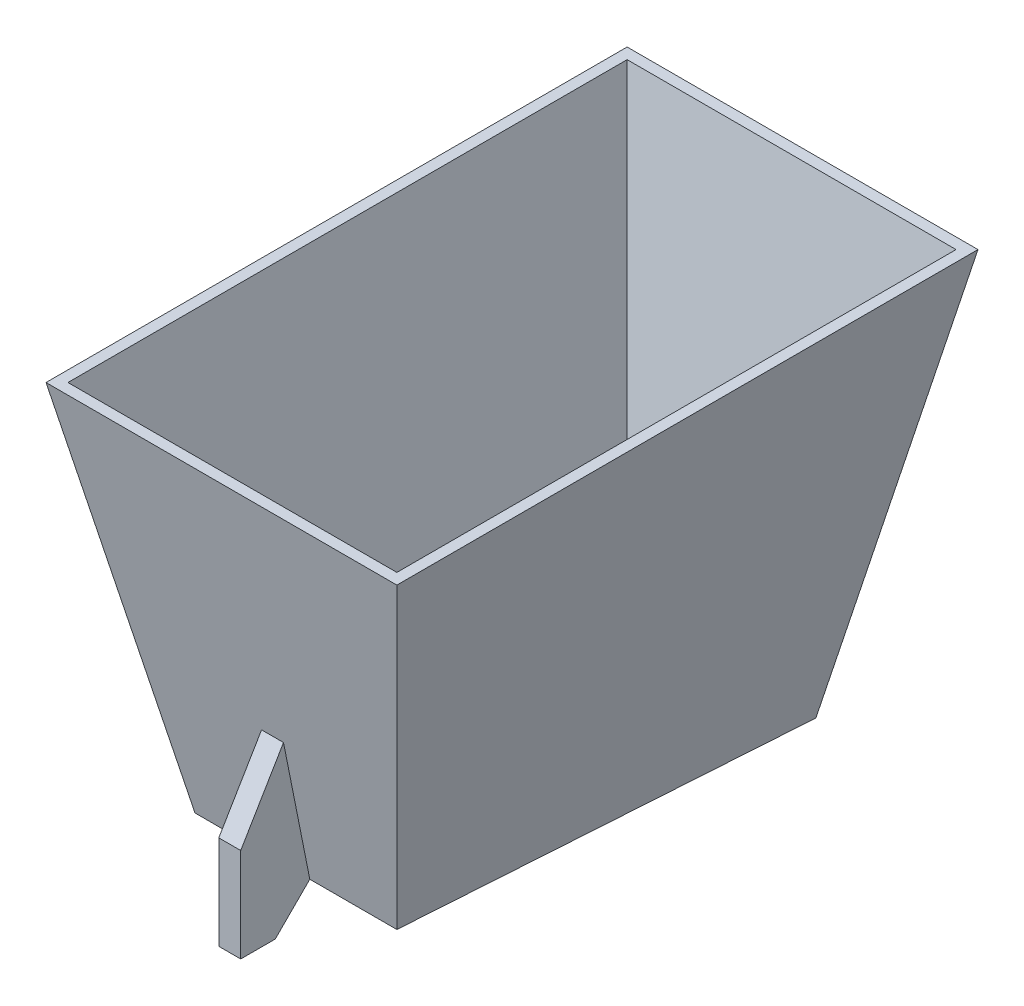
ISO-10303-21;
HEADER;
FILE_DESCRIPTION(('STEP AP214'),'2;1');
FILE_NAME('part.step','',(''),(''),'','','');
FILE_SCHEMA(('AUTOMOTIVE_DESIGN { 1 0 10303 214 1 1 1 1 }'));
ENDSEC;
DATA;
#1=APPLICATION_CONTEXT('core data for automotive mechanical design processes');
#2=APPLICATION_PROTOCOL_DEFINITION('international standard','automotive_design',2000,#1);
#3=PRODUCT_CONTEXT('',#1,'mechanical');
#4=PRODUCT('Part','Part','',(#3));
#5=PRODUCT_RELATED_PRODUCT_CATEGORY('part','',(#4));
#6=PRODUCT_DEFINITION_FORMATION('','',#4);
#7=PRODUCT_DEFINITION_CONTEXT('part definition',#1,'design');
#8=PRODUCT_DEFINITION('design','',#6,#7);
#9=PRODUCT_DEFINITION_SHAPE('','',#8);
#10=(LENGTH_UNIT() NAMED_UNIT(*) SI_UNIT(.MILLI.,.METRE.));
#11=(NAMED_UNIT(*) PLANE_ANGLE_UNIT() SI_UNIT($,.RADIAN.));
#12=(NAMED_UNIT(*) SI_UNIT($,.STERADIAN.) SOLID_ANGLE_UNIT());
#13=UNCERTAINTY_MEASURE_WITH_UNIT(LENGTH_MEASURE(1.E-05),#10,'distance_accuracy_value','');
#14=(GEOMETRIC_REPRESENTATION_CONTEXT(3) GLOBAL_UNCERTAINTY_ASSIGNED_CONTEXT((#13)) GLOBAL_UNIT_ASSIGNED_CONTEXT((#10,
#11,#12)) REPRESENTATION_CONTEXT('',''));
#15=CARTESIAN_POINT('',(0.,0.,0.));
#16=DIRECTION('',(0.,0.,1.));
#17=DIRECTION('',(1.,0.,0.));
#18=AXIS2_PLACEMENT_3D('',#15,#16,#17);
#19=CARTESIAN_POINT('',(-278.502356020751,235.900000000131,196.151832460941));
#20=DIRECTION('',(1.15994049915103E-12,-0.195090322015335,0.980785280403388));
#21=DIRECTION('',(2.307265107047E-13,0.980785280403388,0.195090322015335));
#22=AXIS2_PLACEMENT_3D('',#19,#20,#21);
#23=PLANE('',#22);
#24=DIRECTION('',(1.,0.,-1.18266507698195E-12));
#25=VECTOR('',#24,1.);
#26=CARTESIAN_POINT('',(-278.5023560208,25.9852869008242,154.397199930713));
#27=LINE('',#26,#25);
#28=CARTESIAN_POINT('',(-236.747723490402,25.9852869008242,154.397199930664));
#29=VERTEX_POINT('',#28);
#30=CARTESIAN_POINT('',(-129.756988551199,25.9852869008242,154.397199930537));
#31=VERTEX_POINT('',#30);
#32=EDGE_CURVE('E57',#29,#31,#27,.T.);
#33=ORIENTED_EDGE('',*,*,#32,.F.);
#34=DIRECTION('',(-0.191480453955097,0.962637248139934,0.191480453954771));
#35=VECTOR('',#34,1.);
#36=CARTESIAN_POINT('',(-266.628472119395,176.205954537845,184.277948559605));
#37=LINE('',#36,#35);
#38=CARTESIAN_POINT('',(-278.502356020751,235.900000000131,196.151832460941));
#39=VERTEX_POINT('',#38);
#40=EDGE_CURVE('E245',#29,#39,#37,.T.);
#41=ORIENTED_EDGE('',*,*,#40,.T.);
#42=DIRECTION('',(1.,0.,-1.18266507698195E-12));
#43=VECTOR('',#42,1.);
#44=CARTESIAN_POINT('',(-278.502356020751,235.900000000131,196.151832460941));
#45=LINE('',#44,#43);
#46=CARTESIAN_POINT('',(-88.002356020751,235.900000000131,196.151832460716));
#47=VERTEX_POINT('',#46);
#48=EDGE_CURVE('E232',#39,#47,#45,.T.);
#49=ORIENTED_EDGE('',*,*,#48,.T.);
#50=DIRECTION('',(0.19148045395555,0.962637248139934,0.191480453954318));
#51=VECTOR('',#50,1.);
#52=CARTESIAN_POINT('',(-94.9869936098007,200.785855610551,189.167194871711));
#53=LINE('',#52,#51);
#54=EDGE_CURVE('E147',#31,#47,#53,.T.);
#55=ORIENTED_EDGE('',*,*,#54,.F.);
#56=EDGE_LOOP('',(#33,#41,#49,#55));
#57=FACE_BOUND('',#56,.T.);
#58=ADVANCED_FACE('F41',(#57),#23,.F.);
#59=CARTESIAN_POINT('',(-278.502356021134,235.899999999869,-127.698167539059));
#60=DIRECTION('',(-0.980785280403231,-0.195090322016129,1.31765583014147E-12));
#61=DIRECTION('',(0.195090322016129,-0.98078528040323,5.625845905911E-13));
#62=AXIS2_PLACEMENT_3D('',#59,#60,#61);
#63=PLANE('',#62);
#64=DIRECTION('',(-0.015327226937019,0.0770551732919837,0.996909011085447));
#65=VECTOR('',#64,1.);
#66=CARTESIAN_POINT('',(-232.695075686753,5.61125054808387,-109.193933078214));
#67=LINE('',#66,#65);
#68=CARTESIAN_POINT('',(-233.108496945998,7.68965957175238,-82.3043084638459));
#69=VERTEX_POINT('',#68);
#70=EDGE_CURVE('E64',#69,#29,#67,.T.);
#71=ORIENTED_EDGE('',*,*,#70,.F.);
#72=DIRECTION('',(-0.19148045395555,0.962637248139624,-0.191480453955875));
#73=VECTOR('',#72,1.);
#74=CARTESIAN_POINT('',(-271.517718432084,200.7858556103,-120.713529949997));
#75=LINE('',#74,#73);
#76=CARTESIAN_POINT('',(-278.502356021134,235.899999999869,-127.698167539059));
#77=VERTEX_POINT('',#76);
#78=EDGE_CURVE('E146',#69,#77,#75,.T.);
#79=ORIENTED_EDGE('',*,*,#78,.T.);
#80=DIRECTION('',(1.18257937194685E-12,8.08852984590658E-13,1.));
#81=VECTOR('',#80,1.);
#82=CARTESIAN_POINT('',(-278.502356021134,235.899999999869,-127.698167539059));
#83=LINE('',#82,#81);
#84=EDGE_CURVE('E241',#77,#39,#83,.T.);
#85=ORIENTED_EDGE('',*,*,#84,.T.);
#86=ORIENTED_EDGE('',*,*,#40,.F.);
#87=EDGE_LOOP('',(#71,#79,#85,#86));
#88=FACE_BOUND('',#87,.T.);
#89=ADVANCED_FACE('F310',(#88),#63,.F.);
#90=CARTESIAN_POINT('',(-88.002356021134,235.899999999869,-127.698167539284));
#91=DIRECTION('',(-1.15994049915066E-12,-0.195090322016922,-0.980785280403073));
#92=DIRECTION('',(2.30726510706576E-13,-0.980785280403073,0.195090322016922));
#93=AXIS2_PLACEMENT_3D('',#90,#91,#92);
#94=PLANE('',#93);
#95=DIRECTION('',(-1.,0.,1.18266507698195E-12));
#96=VECTOR('',#95,1.);
#97=CARTESIAN_POINT('',(-88.0023560210803,7.68965957175241,-82.3043084640175));
#98=LINE('',#97,#96);
#99=CARTESIAN_POINT('',(-133.396215096162,7.68965957175236,-82.3043084639638));
#100=VERTEX_POINT('',#99);
#101=EDGE_CURVE('E150',#100,#69,#98,.T.);
#102=ORIENTED_EDGE('',*,*,#101,.F.);
#103=DIRECTION('',(0.191480453955097,0.962637248139624,-0.191480453956328));
#104=VECTOR('',#103,1.);
#105=CARTESIAN_POINT('',(-99.8762399224904,176.205954537602,-115.824283637851));
#106=LINE('',#105,#104);
#107=CARTESIAN_POINT('',(-88.002356021134,235.899999999869,-127.698167539284));
#108=VERTEX_POINT('',#107);
#109=EDGE_CURVE('E137',#100,#108,#106,.T.);
#110=ORIENTED_EDGE('',*,*,#109,.T.);
#111=DIRECTION('',(-1.,0.,1.18266507698195E-12));
#112=VECTOR('',#111,1.);
#113=CARTESIAN_POINT('',(-88.002356021134,235.899999999869,-127.698167539284));
#114=LINE('',#113,#112);
#115=EDGE_CURVE('E238',#108,#77,#114,.T.);
#116=ORIENTED_EDGE('',*,*,#115,.T.);
#117=ORIENTED_EDGE('',*,*,#78,.F.);
#118=EDGE_LOOP('',(#102,#110,#116,#117));
#119=FACE_BOUND('',#118,.T.);
#120=ADVANCED_FACE('F151',(#119),#94,.F.);
#121=CARTESIAN_POINT('',(-88.002356020751,235.900000000131,196.151832460716));
#122=DIRECTION('',(0.980785280403231,-0.195090322016129,-1.00197299344959E-12));
#123=DIRECTION('',(0.195090322016129,0.98078528040323,-1.02403761200238E-12));
#124=AXIS2_PLACEMENT_3D('',#121,#122,#123);
#125=PLANE('',#124);
#126=DIRECTION('',(-0.0153272269393768,-0.0770551732919837,-0.996909011085411));
#127=VECTOR('',#126,1.);
#128=CARTESIAN_POINT('',(-128.861256722204,30.4884348987856,212.657127533424));
#129=LINE('',#128,#127);
#130=EDGE_CURVE('E11',#31,#100,#129,.T.);
#131=ORIENTED_EDGE('',*,*,#130,.F.);
#132=ORIENTED_EDGE('',*,*,#54,.T.);
#133=DIRECTION('',(-1.18249366691176E-12,-8.08852984590658E-13,-1.));
#134=VECTOR('',#133,1.);
#135=CARTESIAN_POINT('',(-88.002356020751,235.900000000131,196.151832460716));
#136=LINE('',#135,#134);
#137=EDGE_CURVE('E141',#47,#108,#136,.T.);
#138=ORIENTED_EDGE('',*,*,#137,.T.);
#139=ORIENTED_EDGE('',*,*,#109,.F.);
#140=EDGE_LOOP('',(#131,#132,#138,#139));
#141=FACE_BOUND('',#140,.T.);
#142=ADVANCED_FACE('F139',(#141),#125,.F.);
#143=CARTESIAN_POINT('',(-81.6523560211415,235.899999999864,-134.048167539291));
#144=DIRECTION('',(0.980614658546613,-0.195946144242518,-1.00108534273686E-12));
#145=DIRECTION('',(0.195946144242518,0.980614658546613,-1.02491175506367E-12));
#146=AXIS2_PLACEMENT_3D('',#143,#144,#145);
#147=PLANE('',#146);
#148=DIRECTION('',(-0.0153971264380116,-0.0770550905300004,-0.996907940343975));
#149=VECTOR('',#148,1.);
#150=CARTESIAN_POINT('',(-129.03074139707,-1.20565664639494,-114.9895483236));
#151=LINE('',#150,#149);
#152=CARTESIAN_POINT('',(-128.599998694522,0.949999999902085,-87.1005248656101));
#153=VERTEX_POINT('',#152);
#154=CARTESIAN_POINT('',(-124.79343307206,20.0000000001014,159.360755409669));
#155=VERTEX_POINT('',#154);
#156=EDGE_CURVE('E228',#153,#155,#151,.F.);
#157=ORIENTED_EDGE('',*,*,#156,.F.);
#158=DIRECTION('',(0.192289447047811,0.962314676759957,-0.192289447049044));
#159=VECTOR('',#158,1.);
#160=CARTESIAN_POINT('',(-81.6523560211415,235.899999999864,-134.048167539291));
#161=LINE('',#160,#159);
#162=CARTESIAN_POINT('',(-81.6523560211415,235.899999999864,-134.048167539291));
#163=VERTEX_POINT('',#162);
#164=EDGE_CURVE('E268',#153,#163,#161,.T.);
#165=ORIENTED_EDGE('',*,*,#164,.T.);
#166=DIRECTION('',(1.18250013521629E-12,8.08852984590658E-13,1.));
#167=VECTOR('',#166,1.);
#168=CARTESIAN_POINT('',(-81.6523560211415,235.899999999864,-134.048167539291));
#169=LINE('',#168,#167);
#170=CARTESIAN_POINT('',(-81.6523560207435,235.900000000136,202.501832460709));
#171=VERTEX_POINT('',#170);
#172=EDGE_CURVE('E248',#163,#171,#169,.T.);
#173=ORIENTED_EDGE('',*,*,#172,.T.);
#174=DIRECTION('',(0.192289447048266,0.962314676760268,0.192289447047033));
#175=VECTOR('',#174,1.);
#176=CARTESIAN_POINT('',(-81.6523560207435,235.900000000136,202.501832460709));
#177=LINE('',#176,#175);
#178=EDGE_CURVE('E50',#155,#171,#177,.T.);
#179=ORIENTED_EDGE('',*,*,#178,.F.);
#180=EDGE_LOOP('',(#157,#165,#173,#179));
#181=FACE_BOUND('',#180,.T.);
#182=ADVANCED_FACE('F299',(#181),#147,.T.);
#183=CARTESIAN_POINT('',(-81.6523560207435,235.900000000136,202.501832460709));
#184=DIRECTION('',(1.15973871063984E-12,-0.195946144241725,0.980614658546772));
#185=DIRECTION('',(2.31738661763956E-13,0.980614658546772,0.195946144241725));
#186=AXIS2_PLACEMENT_3D('',#183,#184,#185);
#187=PLANE('',#186);
#188=DIRECTION('',(1.,0.,-1.18266507698195E-12));
#189=VECTOR('',#188,1.);
#190=CARTESIAN_POINT('',(-187.922312041719,96.2000000001137,174.587017898364));
#191=LINE('',#190,#189);
#192=CARTESIAN_POINT('',(-187.922312041719,96.2000000001137,174.587017898364));
#193=VERTEX_POINT('',#192);
#194=CARTESIAN_POINT('',(-175.222312041719,96.2000000001137,174.587017898349));
#195=VERTEX_POINT('',#194);
#196=EDGE_CURVE('E185',#193,#195,#191,.T.);
#197=ORIENTED_EDGE('',*,*,#196,.T.);
#198=DIRECTION('',(-2.31738661763955E-13,-0.980614658546772,-0.195946144241725));
#199=VECTOR('',#198,1.);
#200=CARTESIAN_POINT('',(-175.222312041695,196.989746477781,194.726796586409));
#201=LINE('',#200,#199);
#202=CARTESIAN_POINT('',(-175.222312041737,20.0000000001014,159.360755409729));
#203=VERTEX_POINT('',#202);
#204=EDGE_CURVE('E157',#195,#203,#201,.T.);
#205=ORIENTED_EDGE('',*,*,#204,.T.);
#206=DIRECTION('',(1.,0.,-1.18266507698195E-12));
#207=VECTOR('',#206,1.);
#208=CARTESIAN_POINT('',(-326.504712041737,20.0000000001014,159.360755409908));
#209=LINE('',#208,#207);
#210=EDGE_CURVE('E220',#203,#155,#209,.T.);
#211=ORIENTED_EDGE('',*,*,#210,.T.);
#212=ORIENTED_EDGE('',*,*,#178,.T.);
#213=DIRECTION('',(-1.,0.,1.18266507698195E-12));
#214=VECTOR('',#213,1.);
#215=CARTESIAN_POINT('',(-81.6523560207435,235.900000000136,202.501832460709));
#216=LINE('',#215,#214);
#217=CARTESIAN_POINT('',(-284.852356020744,235.900000000136,202.501832460949));
#218=VERTEX_POINT('',#217);
#219=EDGE_CURVE('E256',#171,#218,#216,.T.);
#220=ORIENTED_EDGE('',*,*,#219,.T.);
#221=DIRECTION('',(-0.192289447047811,0.962314676760268,0.192289447047487));
#222=VECTOR('',#221,1.);
#223=CARTESIAN_POINT('',(-272.408341877593,173.623792794713,190.05781831782));
#224=LINE('',#223,#222);
#225=CARTESIAN_POINT('',(-241.711278969529,20.0000000001014,159.360755409807));
#226=VERTEX_POINT('',#225);
#227=EDGE_CURVE('E271',#226,#218,#224,.T.);
#228=ORIENTED_EDGE('',*,*,#227,.F.);
#229=CARTESIAN_POINT('',(-187.922312041737,20.0000000001014,159.360755409744));
#230=VERTEX_POINT('',#229);
#231=EDGE_CURVE('E221',#226,#230,#209,.T.);
#232=ORIENTED_EDGE('',*,*,#231,.T.);
#233=DIRECTION('',(-2.31738661763955E-13,-0.980614658546772,-0.195946144241725));
#234=VECTOR('',#233,1.);
#235=CARTESIAN_POINT('',(-187.922312041695,196.989746477781,194.726796586424));
#236=LINE('',#235,#234);
#237=EDGE_CURVE('E166',#193,#230,#236,.T.);
#238=ORIENTED_EDGE('',*,*,#237,.F.);
#239=EDGE_LOOP('',(#197,#205,#211,#212,#220,#228,#232,#238));
#240=FACE_BOUND('',#239,.T.);
#241=ADVANCED_FACE('F43',(#240),#187,.T.);
#242=CARTESIAN_POINT('',(-284.852356021142,235.899999999864,-134.048167539051));
#243=DIRECTION('',(-0.980614658546613,-0.195946144242518,1.31814946207264E-12));
#244=DIRECTION('',(0.195946144242518,-0.980614658546613,5.61434431533883E-13));
#245=AXIS2_PLACEMENT_3D('',#242,#243,#244);
#246=PLANE('',#245);
#247=DIRECTION('',(-0.0153971264356538,0.0770550905300004,0.996907940344011));
#248=VECTOR('',#247,1.);
#249=CARTESIAN_POINT('',(-237.473970645168,-1.20565664639494,-114.989548323472));
#250=LINE('',#249,#248);
#251=CARTESIAN_POINT('',(-237.90471334765,0.949999999902112,-87.1005248654808));
#252=VERTEX_POINT('',#251);
#253=EDGE_CURVE('E225',#226,#252,#250,.F.);
#254=ORIENTED_EDGE('',*,*,#253,.F.);
#255=ORIENTED_EDGE('',*,*,#227,.T.);
#256=DIRECTION('',(-1.18258260609912E-12,-8.08852984590658E-13,-1.));
#257=VECTOR('',#256,1.);
#258=CARTESIAN_POINT('',(-284.852356021142,235.899999999864,-134.048167539051));
#259=LINE('',#258,#257);
#260=CARTESIAN_POINT('',(-284.852356021142,235.899999999864,-134.048167539051));
#261=VERTEX_POINT('',#260);
#262=EDGE_CURVE('E260',#218,#261,#259,.T.);
#263=ORIENTED_EDGE('',*,*,#262,.T.);
#264=DIRECTION('',(-0.192289447048266,0.962314676759957,-0.192289447048589));
#265=VECTOR('',#264,1.);
#266=CARTESIAN_POINT('',(-277.338988991297,198.29927112113,-126.534800509194));
#267=LINE('',#266,#265);
#268=EDGE_CURVE('E274',#252,#261,#267,.T.);
#269=ORIENTED_EDGE('',*,*,#268,.F.);
#270=EDGE_LOOP('',(#254,#255,#263,#269));
#271=FACE_BOUND('',#270,.T.);
#272=ADVANCED_FACE('F280',(#271),#246,.T.);
#273=CARTESIAN_POINT('',(-81.6523560211415,235.899999999864,-134.048167539291));
#274=DIRECTION('',(-1.15973871063947E-12,-0.195946144243311,-0.980614658546455));
#275=DIRECTION('',(2.31738661765832E-13,-0.980614658546455,0.195946144243311));
#276=AXIS2_PLACEMENT_3D('',#273,#274,#275);
#277=PLANE('',#276);
#278=DIRECTION('',(1.,0.,-1.18266507698195E-12));
#279=VECTOR('',#278,1.);
#280=CARTESIAN_POINT('',(-326.504712042028,0.949999999902085,-87.100524865376));
#281=LINE('',#280,#279);
#282=EDGE_CURVE('E217',#252,#153,#281,.T.);
#283=ORIENTED_EDGE('',*,*,#282,.F.);
#284=ORIENTED_EDGE('',*,*,#268,.T.);
#285=DIRECTION('',(1.,0.,-1.18266507698195E-12));
#286=VECTOR('',#285,1.);
#287=CARTESIAN_POINT('',(-81.6523560211415,235.899999999864,-134.048167539291));
#288=LINE('',#287,#286);
#289=EDGE_CURVE('E264',#261,#163,#288,.T.);
#290=ORIENTED_EDGE('',*,*,#289,.T.);
#291=ORIENTED_EDGE('',*,*,#164,.F.);
#292=EDGE_LOOP('',(#283,#284,#290,#291));
#293=FACE_BOUND('',#292,.T.);
#294=ADVANCED_FACE('F293',(#293),#277,.T.);
#295=CARTESIAN_POINT('',(-366.504712041925,235.899999999973,3.1247227028075E-10));
#296=DIRECTION('',(0.,-1.,8.08852984590658E-13));
#297=DIRECTION('',(1.18266507698195E-12,8.08852984590658E-13,1.));
#298=AXIS2_PLACEMENT_3D('',#295,#296,#297);
#299=PLANE('',#298);
#300=ORIENTED_EDGE('',*,*,#137,.F.);
#301=ORIENTED_EDGE('',*,*,#48,.F.);
#302=ORIENTED_EDGE('',*,*,#84,.F.);
#303=ORIENTED_EDGE('',*,*,#115,.F.);
#304=EDGE_LOOP('',(#300,#301,#302,#303));
#305=FACE_BOUND('',#304,.T.);
#306=ORIENTED_EDGE('',*,*,#172,.F.);
#307=ORIENTED_EDGE('',*,*,#289,.F.);
#308=ORIENTED_EDGE('',*,*,#262,.F.);
#309=ORIENTED_EDGE('',*,*,#219,.F.);
#310=EDGE_LOOP('',(#306,#307,#308,#309));
#311=FACE_BOUND('',#310,.T.);
#312=ADVANCED_FACE('F289',(#305,#311),#299,.F.);
#313=CARTESIAN_POINT('',(-326.504712041737,20.0000000001014,159.360755409908));
#314=DIRECTION('',(0.,-0.997026130590704,0.0770642259373852));
#315=DIRECTION('',(1.17914798548807E-12,0.0770642259373852,0.997026130590704));
#316=AXIS2_PLACEMENT_3D('',#313,#314,#315);
#317=PLANE('',#316);
#318=ORIENTED_EDGE('',*,*,#156,.T.);
#319=ORIENTED_EDGE('',*,*,#210,.F.);
#320=DIRECTION('',(1.,0.,-1.18266507698195E-12));
#321=VECTOR('',#320,1.);
#322=CARTESIAN_POINT('',(-187.922312041737,20.0000000001014,159.360755409744));
#323=LINE('',#322,#321);
#324=EDGE_CURVE('E213',#230,#203,#323,.T.);
#325=ORIENTED_EDGE('',*,*,#324,.F.);
#326=ORIENTED_EDGE('',*,*,#231,.F.);
#327=ORIENTED_EDGE('',*,*,#253,.T.);
#328=ORIENTED_EDGE('',*,*,#282,.T.);
#329=EDGE_LOOP('',(#318,#319,#325,#326,#327,#328));
#330=FACE_BOUND('',#329,.T.);
#331=ADVANCED_FACE('F296',(#330),#317,.T.);
#332=CARTESIAN_POINT('',(-187.922312041959,207.630377704683,-28.269622295142));
#333=DIRECTION('',(8.36270495805769E-13,0.70710678118712,0.707106781185976));
#334=DIRECTION('',(-8.36270495807122E-13,0.707106781185976,-0.70710678118712));
#335=AXIS2_PLACEMENT_3D('',#332,#333,#334);
#336=PLANE('',#335);
#337=DIRECTION('',(8.36270495807122E-13,-0.707106781185976,0.70710678118712));
#338=VECTOR('',#337,1.);
#339=CARTESIAN_POINT('',(-175.222312041959,207.630377704683,-28.269622295157));
#340=LINE('',#339,#338);
#341=CARTESIAN_POINT('',(-175.222312041713,1.17628129459035E-10,179.360755409745));
#342=VERTEX_POINT('',#341);
#343=EDGE_CURVE('E162',#203,#342,#340,.T.);
#344=ORIENTED_EDGE('',*,*,#343,.T.);
#345=DIRECTION('',(1.,0.,-1.18266507698195E-12));
#346=VECTOR('',#345,1.);
#347=CARTESIAN_POINT('',(-187.922312041713,1.17628129459035E-10,179.36075540976));
#348=LINE('',#347,#346);
#349=CARTESIAN_POINT('',(-187.922312041713,1.17628129459035E-10,179.36075540976));
#350=VERTEX_POINT('',#349);
#351=EDGE_CURVE('E210',#350,#342,#348,.T.);
#352=ORIENTED_EDGE('',*,*,#351,.F.);
#353=DIRECTION('',(8.36270495807122E-13,-0.707106781185976,0.70710678118712));
#354=VECTOR('',#353,1.);
#355=CARTESIAN_POINT('',(-187.922312041959,207.630377704683,-28.269622295142));
#356=LINE('',#355,#354);
#357=EDGE_CURVE('E170',#230,#350,#356,.T.);
#358=ORIENTED_EDGE('',*,*,#357,.F.);
#359=ORIENTED_EDGE('',*,*,#324,.T.);
#360=EDGE_LOOP('',(#344,#352,#358,#359));
#361=FACE_BOUND('',#360,.T.);
#362=ADVANCED_FACE('F326',(#361),#336,.F.);
#363=CARTESIAN_POINT('',(-187.922312041925,-2.7450264283857E-11,2.92071922203263E-10));
#364=DIRECTION('',(0.,-1.,8.08852984590658E-13));
#365=DIRECTION('',(1.18266507698195E-12,8.08852984590658E-13,1.));
#366=AXIS2_PLACEMENT_3D('',#363,#364,#365);
#367=PLANE('',#366);
#368=DIRECTION('',(-1.18266507698195E-12,-8.08852984590658E-13,-1.));
#369=VECTOR('',#368,1.);
#370=CARTESIAN_POINT('',(-175.222312041925,-2.7450264283857E-11,2.77056155795208E-10));
#371=LINE('',#370,#369);
#372=CARTESIAN_POINT('',(-175.22231204169,1.33809630042947E-10,199.360755409745));
#373=VERTEX_POINT('',#372);
#374=EDGE_CURVE('E190',#373,#342,#371,.T.);
#375=ORIENTED_EDGE('',*,*,#374,.F.);
#376=DIRECTION('',(1.,0.,-1.18266507698195E-12));
#377=VECTOR('',#376,1.);
#378=CARTESIAN_POINT('',(-187.92231204169,1.33809630042947E-10,199.36075540976));
#379=LINE('',#378,#377);
#380=CARTESIAN_POINT('',(-187.92231204169,1.33809630042947E-10,199.36075540976));
#381=VERTEX_POINT('',#380);
#382=EDGE_CURVE('E207',#381,#373,#379,.T.);
#383=ORIENTED_EDGE('',*,*,#382,.F.);
#384=DIRECTION('',(-1.18266507698195E-12,-8.08852984590658E-13,-1.));
#385=VECTOR('',#384,1.);
#386=CARTESIAN_POINT('',(-187.922312041925,-2.7450264283857E-11,2.92071922203263E-10));
#387=LINE('',#386,#385);
#388=EDGE_CURVE('E174',#381,#350,#387,.T.);
#389=ORIENTED_EDGE('',*,*,#388,.T.);
#390=ORIENTED_EDGE('',*,*,#351,.T.);
#391=EDGE_LOOP('',(#375,#383,#389,#390));
#392=FACE_BOUND('',#391,.T.);
#393=ADVANCED_FACE('F391',(#392),#367,.T.);
#394=CARTESIAN_POINT('',(-187.92231204169,235.900000000134,199.360755409569));
#395=DIRECTION('',(1.18266507698195E-12,8.08852984590658E-13,1.));
#396=DIRECTION('',(-1.,0.,1.18266507698195E-12));
#397=AXIS2_PLACEMENT_3D('',#394,#395,#396);
#398=PLANE('',#397);
#399=DIRECTION('',(0.,-1.,8.08852984590658E-13));
#400=VECTOR('',#399,1.);
#401=CARTESIAN_POINT('',(-175.22231204169,235.900000000134,199.360755409554));
#402=LINE('',#401,#400);
#403=CARTESIAN_POINT('',(-175.22231204169,54.4262656221806,199.360755409701));
#404=VERTEX_POINT('',#403);
#405=EDGE_CURVE('E194',#404,#373,#402,.T.);
#406=ORIENTED_EDGE('',*,*,#405,.F.);
#407=DIRECTION('',(1.,0.,-1.18266507698195E-12));
#408=VECTOR('',#407,1.);
#409=CARTESIAN_POINT('',(-187.92231204169,54.4262656221806,199.360755409716));
#410=LINE('',#409,#408);
#411=CARTESIAN_POINT('',(-187.92231204169,54.4262656221806,199.360755409716));
#412=VERTEX_POINT('',#411);
#413=EDGE_CURVE('E204',#412,#404,#410,.T.);
#414=ORIENTED_EDGE('',*,*,#413,.F.);
#415=DIRECTION('',(0.,-1.,8.08852984590658E-13));
#416=VECTOR('',#415,1.);
#417=CARTESIAN_POINT('',(-187.92231204169,235.900000000134,199.360755409569));
#418=LINE('',#417,#416);
#419=EDGE_CURVE('E178',#412,#381,#418,.T.);
#420=ORIENTED_EDGE('',*,*,#419,.T.);
#421=ORIENTED_EDGE('',*,*,#382,.T.);
#422=EDGE_LOOP('',(#406,#414,#420,#421));
#423=FACE_BOUND('',#422,.T.);
#424=ADVANCED_FACE('F398',(#423),#398,.T.);
#425=CARTESIAN_POINT('',(-187.922312041845,276.149323298653,67.868828415684));
#426=DIRECTION('',(1.01723450514506E-12,0.510090859597678,0.860120523505225));
#427=DIRECTION('',(-6.03266645733876E-13,0.860120523505225,-0.510090859597679));
#428=AXIS2_PLACEMENT_3D('',#425,#426,#427);
#429=PLANE('',#428);
#430=DIRECTION('',(6.03266645733876E-13,-0.860120523505225,0.510090859597679));
#431=VECTOR('',#430,1.);
#432=CARTESIAN_POINT('',(-175.222312041845,276.149323298653,67.868828415669));
#433=LINE('',#432,#431);
#434=EDGE_CURVE('E171',#195,#404,#433,.T.);
#435=ORIENTED_EDGE('',*,*,#434,.F.);
#436=ORIENTED_EDGE('',*,*,#196,.F.);
#437=DIRECTION('',(6.03266645733876E-13,-0.860120523505225,0.510090859597679));
#438=VECTOR('',#437,1.);
#439=CARTESIAN_POINT('',(-187.922312041845,276.149323298653,67.868828415684));
#440=LINE('',#439,#438);
#441=EDGE_CURVE('E182',#193,#412,#440,.T.);
#442=ORIENTED_EDGE('',*,*,#441,.T.);
#443=ORIENTED_EDGE('',*,*,#413,.T.);
#444=EDGE_LOOP('',(#435,#436,#442,#443));
#445=FACE_BOUND('',#444,.T.);
#446=ADVANCED_FACE('F407',(#445),#429,.T.);
#447=CARTESIAN_POINT('',(-187.922312041925,235.899999999973,1.01266217633622E-10));
#448=DIRECTION('',(-1.,0.,1.18266507698195E-12));
#449=DIRECTION('',(-1.18266507698195E-12,-8.08852984590658E-13,-1.));
#450=AXIS2_PLACEMENT_3D('',#447,#448,#449);
#451=PLANE('',#450);
#452=ORIENTED_EDGE('',*,*,#237,.T.);
#453=ORIENTED_EDGE('',*,*,#357,.T.);
#454=ORIENTED_EDGE('',*,*,#388,.F.);
#455=ORIENTED_EDGE('',*,*,#419,.F.);
#456=ORIENTED_EDGE('',*,*,#441,.F.);
#457=EDGE_LOOP('',(#452,#453,#454,#455,#456));
#458=FACE_BOUND('',#457,.T.);
#459=ADVANCED_FACE('F416',(#458),#451,.T.);
#460=CARTESIAN_POINT('',(-175.222312041925,235.899999999973,8.62504512255668E-11));
#461=DIRECTION('',(-1.,0.,1.18266507698195E-12));
#462=DIRECTION('',(-1.18266507698195E-12,-8.08852984590658E-13,-1.));
#463=AXIS2_PLACEMENT_3D('',#460,#461,#462);
#464=PLANE('',#463);
#465=ORIENTED_EDGE('',*,*,#204,.F.);
#466=ORIENTED_EDGE('',*,*,#434,.T.);
#467=ORIENTED_EDGE('',*,*,#405,.T.);
#468=ORIENTED_EDGE('',*,*,#374,.T.);
#469=ORIENTED_EDGE('',*,*,#343,.F.);
#470=EDGE_LOOP('',(#465,#466,#467,#468,#469));
#471=FACE_BOUND('',#470,.T.);
#472=ADVANCED_FACE('F426',(#471),#464,.F.);
#473=CARTESIAN_POINT('',(-366.504712041905,15.3688322116439,17.0457555921004));
#474=DIRECTION('',(0.,-0.997026130590704,0.0770642259373852));
#475=DIRECTION('',(1.17914798548807E-12,0.0770642259373852,0.997026130590704));
#476=AXIS2_PLACEMENT_3D('',#473,#474,#475);
#477=PLANE('',#476);
#478=ORIENTED_EDGE('',*,*,#70,.T.);
#479=ORIENTED_EDGE('',*,*,#32,.T.);
#480=ORIENTED_EDGE('',*,*,#130,.T.);
#481=ORIENTED_EDGE('',*,*,#101,.T.);
#482=EDGE_LOOP('',(#478,#479,#480,#481));
#483=FACE_BOUND('',#482,.T.);
#484=ADVANCED_FACE('F155',(#483),#477,.F.);
#485=CLOSED_SHELL('',(#58,#89,#120,#142,#182,#241,#272,#294,#312,#331,#362,#393,#424,#446,#459,
#472,#484));
#486=MANIFOLD_SOLID_BREP('B2',#485);
#487=ADVANCED_BREP_SHAPE_REPRESENTATION('',(#18,#486),#14);
#488=SHAPE_DEFINITION_REPRESENTATION(#9,#487);
ENDSEC;
END-ISO-10303-21;
